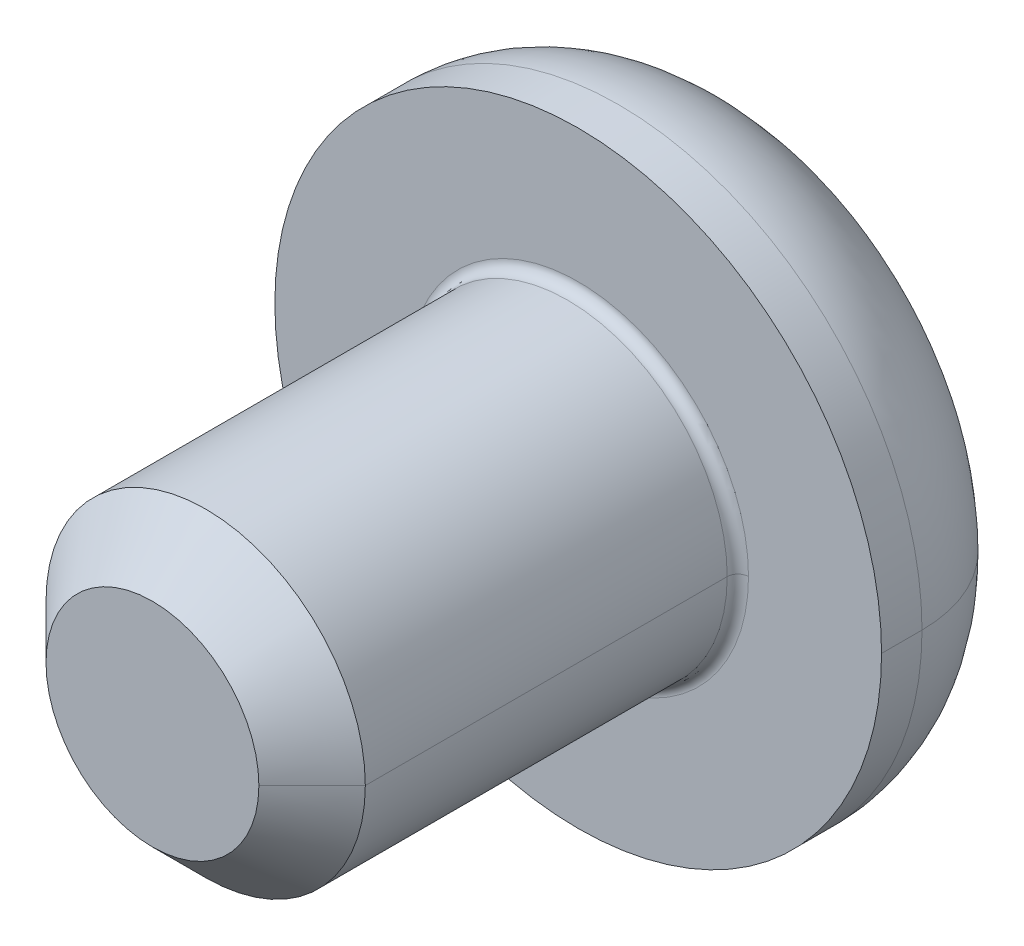
ISO-10303-21;
HEADER;
FILE_DESCRIPTION(('STEP AP214'),'2;1');
FILE_NAME('part.step','',(''),(''),'','','');
FILE_SCHEMA(('AUTOMOTIVE_DESIGN { 1 0 10303 214 1 1 1 1 }'));
ENDSEC;
DATA;
#1=APPLICATION_CONTEXT('core data for automotive mechanical design processes');
#2=APPLICATION_PROTOCOL_DEFINITION('international standard','automotive_design',2000,#1);
#3=PRODUCT_CONTEXT('',#1,'mechanical');
#4=PRODUCT('Part','Part','',(#3));
#5=PRODUCT_RELATED_PRODUCT_CATEGORY('part','',(#4));
#6=PRODUCT_DEFINITION_FORMATION('','',#4);
#7=PRODUCT_DEFINITION_CONTEXT('part definition',#1,'design');
#8=PRODUCT_DEFINITION('design','',#6,#7);
#9=PRODUCT_DEFINITION_SHAPE('','',#8);
#10=(LENGTH_UNIT() NAMED_UNIT(*) SI_UNIT(.MILLI.,.METRE.));
#11=(NAMED_UNIT(*) PLANE_ANGLE_UNIT() SI_UNIT($,.RADIAN.));
#12=(NAMED_UNIT(*) SI_UNIT($,.STERADIAN.) SOLID_ANGLE_UNIT());
#13=UNCERTAINTY_MEASURE_WITH_UNIT(LENGTH_MEASURE(1.E-05),#10,'distance_accuracy_value','');
#14=(GEOMETRIC_REPRESENTATION_CONTEXT(3) GLOBAL_UNCERTAINTY_ASSIGNED_CONTEXT((#13)) GLOBAL_UNIT_ASSIGNED_CONTEXT((#10,
#11,#12)) REPRESENTATION_CONTEXT('',''));
#15=CARTESIAN_POINT('',(0.,0.,0.));
#16=DIRECTION('',(0.,0.,1.));
#17=DIRECTION('',(1.,0.,0.));
#18=AXIS2_PLACEMENT_3D('',#15,#16,#17);
#19=CARTESIAN_POINT('',(0.,0.,0.1));
#20=DIRECTION('',(0.,0.,-1.));
#21=DIRECTION('',(-1.,0.,0.));
#22=AXIS2_PLACEMENT_3D('',#19,#20,#21);
#23=TOROIDAL_SURFACE('',#22,1.6,0.1);
#24=CARTESIAN_POINT('',(1.6,0.,0.1));
#25=DIRECTION('',(0.,1.,0.));
#26=DIRECTION('',(-1.,0.,0.));
#27=AXIS2_PLACEMENT_3D('',#24,#25,#26);
#28=CIRCLE('',#27,0.1);
#29=CARTESIAN_POINT('',(1.6,0.,0.));
#30=VERTEX_POINT('',#29);
#31=CARTESIAN_POINT('',(1.5,0.,0.1));
#32=VERTEX_POINT('',#31);
#33=EDGE_CURVE('E227',#30,#32,#28,.T.);
#34=ORIENTED_EDGE('',*,*,#33,.F.);
#35=CARTESIAN_POINT('',(0.,0.,0.));
#36=DIRECTION('',(0.,0.,-1.));
#37=DIRECTION('',(-1.,0.,0.));
#38=AXIS2_PLACEMENT_3D('',#35,#36,#37);
#39=CIRCLE('',#38,1.6);
#40=CARTESIAN_POINT('',(-1.6,0.,0.));
#41=VERTEX_POINT('',#40);
#42=EDGE_CURVE('E194',#41,#30,#39,.T.);
#43=ORIENTED_EDGE('',*,*,#42,.F.);
#44=CARTESIAN_POINT('',(-1.6,0.,0.1));
#45=DIRECTION('',(0.,-1.,0.));
#46=DIRECTION('',(0.,0.,-1.));
#47=AXIS2_PLACEMENT_3D('',#44,#45,#46);
#48=CIRCLE('',#47,0.1);
#49=CARTESIAN_POINT('',(-1.5,0.,0.1));
#50=VERTEX_POINT('',#49);
#51=EDGE_CURVE('E231',#41,#50,#48,.T.);
#52=ORIENTED_EDGE('',*,*,#51,.T.);
#53=CARTESIAN_POINT('',(0.,0.,0.1));
#54=DIRECTION('',(0.,0.,1.));
#55=DIRECTION('',(-1.,0.,0.));
#56=AXIS2_PLACEMENT_3D('',#53,#54,#55);
#57=CIRCLE('',#56,1.5);
#58=EDGE_CURVE('E263',#32,#50,#57,.T.);
#59=ORIENTED_EDGE('',*,*,#58,.F.);
#60=EDGE_LOOP('',(#34,#43,#52,#59));
#61=FACE_BOUND('',#60,.T.);
#62=ADVANCED_FACE('F17',(#61),#23,.F.);
#63=CARTESIAN_POINT('',(0.,0.,-0.38));
#64=DIRECTION('',(0.,0.,-1.));
#65=DIRECTION('',(-1.,0.,0.));
#66=AXIS2_PLACEMENT_3D('',#63,#64,#65);
#67=TOROIDAL_SURFACE('',#66,1.58,1.27);
#68=CARTESIAN_POINT('',(1.58,0.,-0.38));
#69=DIRECTION('',(0.,1.,0.));
#70=DIRECTION('',(-1.,0.,0.));
#71=AXIS2_PLACEMENT_3D('',#68,#69,#70);
#72=CIRCLE('',#71,1.27);
#73=CARTESIAN_POINT('',(2.85,0.,-0.38));
#74=VERTEX_POINT('',#73);
#75=CARTESIAN_POINT('',(1.58,0.,-1.65));
#76=VERTEX_POINT('',#75);
#77=EDGE_CURVE('E244',#74,#76,#72,.T.);
#78=ORIENTED_EDGE('',*,*,#77,.F.);
#79=CARTESIAN_POINT('',(0.,0.,-0.38));
#80=DIRECTION('',(0.,0.,1.));
#81=DIRECTION('',(-1.,0.,0.));
#82=AXIS2_PLACEMENT_3D('',#79,#80,#81);
#83=CIRCLE('',#82,2.85);
#84=CARTESIAN_POINT('',(-2.85,0.,-0.38));
#85=VERTEX_POINT('',#84);
#86=EDGE_CURVE('E302',#85,#74,#83,.T.);
#87=ORIENTED_EDGE('',*,*,#86,.F.);
#88=CARTESIAN_POINT('',(-1.58,0.,-0.38));
#89=DIRECTION('',(0.,-1.,0.));
#90=DIRECTION('',(0.,0.,-1.));
#91=AXIS2_PLACEMENT_3D('',#88,#89,#90);
#92=CIRCLE('',#91,1.27);
#93=CARTESIAN_POINT('',(-1.58,0.,-1.65));
#94=VERTEX_POINT('',#93);
#95=EDGE_CURVE('E243',#85,#94,#92,.T.);
#96=ORIENTED_EDGE('',*,*,#95,.T.);
#97=CARTESIAN_POINT('',(0.,0.,-1.65));
#98=DIRECTION('',(0.,0.,-1.));
#99=DIRECTION('',(-1.,0.,0.));
#100=AXIS2_PLACEMENT_3D('',#97,#98,#99);
#101=CIRCLE('',#100,1.58);
#102=EDGE_CURVE('E180',#76,#94,#101,.T.);
#103=ORIENTED_EDGE('',*,*,#102,.F.);
#104=EDGE_LOOP('',(#78,#87,#96,#103));
#105=FACE_BOUND('',#104,.T.);
#106=ADVANCED_FACE('F595',(#105),#67,.T.);
#107=CARTESIAN_POINT('',(0.,0.,-0.61));
#108=DIRECTION('',(0.,0.,-1.));
#109=DIRECTION('',(0.,-1.,0.));
#110=AXIS2_PLACEMENT_3D('',#107,#108,#109);
#111=PLANE('',#110);
#112=DIRECTION('',(-1.,0.,0.));
#113=VECTOR('',#112,1.);
#114=CARTESIAN_POINT('',(0.577350269189626,-1.,-0.61));
#115=LINE('',#114,#113);
#116=CARTESIAN_POINT('',(0.577350269189626,-1.,-0.61));
#117=VERTEX_POINT('',#116);
#118=CARTESIAN_POINT('',(-0.577350269189626,-1.,-0.61));
#119=VERTEX_POINT('',#118);
#120=EDGE_CURVE('E198',#117,#119,#115,.T.);
#121=ORIENTED_EDGE('',*,*,#120,.T.);
#122=DIRECTION('',(-0.5,0.866025403784439,0.));
#123=VECTOR('',#122,1.);
#124=CARTESIAN_POINT('',(-0.577350269189626,-1.,-0.61));
#125=LINE('',#124,#123);
#126=CARTESIAN_POINT('',(-1.15470053837925,0.,-0.61));
#127=VERTEX_POINT('',#126);
#128=EDGE_CURVE('E11',#119,#127,#125,.T.);
#129=ORIENTED_EDGE('',*,*,#128,.T.);
#130=DIRECTION('',(0.5,0.866025403784439,0.));
#131=VECTOR('',#130,1.);
#132=CARTESIAN_POINT('',(-1.15470053837925,0.,-0.61));
#133=LINE('',#132,#131);
#134=CARTESIAN_POINT('',(-0.577350269189626,1.,-0.61));
#135=VERTEX_POINT('',#134);
#136=EDGE_CURVE('E45',#127,#135,#133,.T.);
#137=ORIENTED_EDGE('',*,*,#136,.T.);
#138=DIRECTION('',(1.,0.,0.));
#139=VECTOR('',#138,1.);
#140=CARTESIAN_POINT('',(-0.577350269189626,1.,-0.61));
#141=LINE('',#140,#139);
#142=CARTESIAN_POINT('',(0.577350269189626,1.,-0.61));
#143=VERTEX_POINT('',#142);
#144=EDGE_CURVE('E208',#135,#143,#141,.T.);
#145=ORIENTED_EDGE('',*,*,#144,.T.);
#146=DIRECTION('',(0.5,-0.866025403784439,0.));
#147=VECTOR('',#146,1.);
#148=CARTESIAN_POINT('',(0.577350269189626,1.,-0.61));
#149=LINE('',#148,#147);
#150=CARTESIAN_POINT('',(1.15470053837925,0.,-0.61));
#151=VERTEX_POINT('',#150);
#152=EDGE_CURVE('E157',#143,#151,#149,.T.);
#153=ORIENTED_EDGE('',*,*,#152,.T.);
#154=DIRECTION('',(-0.5,-0.866025403784439,0.));
#155=VECTOR('',#154,1.);
#156=CARTESIAN_POINT('',(1.15470053837925,0.,-0.61));
#157=LINE('',#156,#155);
#158=EDGE_CURVE('E153',#151,#117,#157,.T.);
#159=ORIENTED_EDGE('',*,*,#158,.T.);
#160=EDGE_LOOP('',(#121,#129,#137,#145,#153,#159));
#161=FACE_BOUND('',#160,.T.);
#162=ADVANCED_FACE('F586',(#161),#111,.T.);
#163=CARTESIAN_POINT('',(-0.577350269189626,-1.,-0.61));
#164=DIRECTION('',(-0.866025403784439,-0.5,0.));
#165=DIRECTION('',(-0.5,0.866025403784439,0.));
#166=AXIS2_PLACEMENT_3D('',#163,#164,#165);
#167=PLANE('',#166);
#168=DIRECTION('',(-0.5,0.866025403784439,0.));
#169=VECTOR('',#168,1.);
#170=CARTESIAN_POINT('',(-0.577350269189626,-1.,-1.65));
#171=LINE('',#170,#169);
#172=CARTESIAN_POINT('',(-0.577350269189626,-1.,-1.65));
#173=VERTEX_POINT('',#172);
#174=CARTESIAN_POINT('',(-1.15470053837925,0.,-1.65));
#175=VERTEX_POINT('',#174);
#176=EDGE_CURVE('E190',#173,#175,#171,.T.);
#177=ORIENTED_EDGE('',*,*,#176,.T.);
#178=DIRECTION('',(0.,0.,-1.));
#179=VECTOR('',#178,1.);
#180=CARTESIAN_POINT('',(-1.15470053837925,0.,-0.61));
#181=LINE('',#180,#179);
#182=EDGE_CURVE('E20',#127,#175,#181,.T.);
#183=ORIENTED_EDGE('',*,*,#182,.F.);
#184=ORIENTED_EDGE('',*,*,#128,.F.);
#185=DIRECTION('',(0.,0.,-1.));
#186=VECTOR('',#185,1.);
#187=CARTESIAN_POINT('',(-0.577350269189626,-1.,-0.61));
#188=LINE('',#187,#186);
#189=EDGE_CURVE('E197',#119,#173,#188,.T.);
#190=ORIENTED_EDGE('',*,*,#189,.T.);
#191=EDGE_LOOP('',(#177,#183,#184,#190));
#192=FACE_BOUND('',#191,.T.);
#193=ADVANCED_FACE('F577',(#192),#167,.F.);
#194=CARTESIAN_POINT('',(-1.15470053837925,0.,-0.61));
#195=DIRECTION('',(-0.866025403784439,0.5,0.));
#196=DIRECTION('',(0.,0.,1.));
#197=AXIS2_PLACEMENT_3D('',#194,#195,#196);
#198=PLANE('',#197);
#199=DIRECTION('',(0.5,0.866025403784439,0.));
#200=VECTOR('',#199,1.);
#201=CARTESIAN_POINT('',(-1.15470053837925,0.,-1.65));
#202=LINE('',#201,#200);
#203=CARTESIAN_POINT('',(-0.577350269189626,1.,-1.65));
#204=VERTEX_POINT('',#203);
#205=EDGE_CURVE('E186',#175,#204,#202,.T.);
#206=ORIENTED_EDGE('',*,*,#205,.T.);
#207=DIRECTION('',(0.,0.,-1.));
#208=VECTOR('',#207,1.);
#209=CARTESIAN_POINT('',(-0.577350269189626,1.,-0.61));
#210=LINE('',#209,#208);
#211=EDGE_CURVE('E210',#135,#204,#210,.T.);
#212=ORIENTED_EDGE('',*,*,#211,.F.);
#213=ORIENTED_EDGE('',*,*,#136,.F.);
#214=ORIENTED_EDGE('',*,*,#182,.T.);
#215=EDGE_LOOP('',(#206,#212,#213,#214));
#216=FACE_BOUND('',#215,.T.);
#217=ADVANCED_FACE('F479',(#216),#198,.F.);
#218=CARTESIAN_POINT('',(-0.577350269189626,1.,-0.61));
#219=DIRECTION('',(0.,1.,0.));
#220=DIRECTION('',(1.,0.,0.));
#221=AXIS2_PLACEMENT_3D('',#218,#219,#220);
#222=PLANE('',#221);
#223=DIRECTION('',(1.,0.,0.));
#224=VECTOR('',#223,1.);
#225=CARTESIAN_POINT('',(-0.577350269189626,1.,-1.65));
#226=LINE('',#225,#224);
#227=CARTESIAN_POINT('',(0.577350269189626,1.,-1.65));
#228=VERTEX_POINT('',#227);
#229=EDGE_CURVE('E168',#204,#228,#226,.T.);
#230=ORIENTED_EDGE('',*,*,#229,.T.);
#231=DIRECTION('',(0.,0.,-1.));
#232=VECTOR('',#231,1.);
#233=CARTESIAN_POINT('',(0.577350269189626,1.,-0.61));
#234=LINE('',#233,#232);
#235=EDGE_CURVE('E163',#143,#228,#234,.T.);
#236=ORIENTED_EDGE('',*,*,#235,.F.);
#237=ORIENTED_EDGE('',*,*,#144,.F.);
#238=ORIENTED_EDGE('',*,*,#211,.T.);
#239=EDGE_LOOP('',(#230,#236,#237,#238));
#240=FACE_BOUND('',#239,.T.);
#241=ADVANCED_FACE('F464',(#240),#222,.F.);
#242=CARTESIAN_POINT('',(0.577350269189626,1.,-0.61));
#243=DIRECTION('',(0.866025403784439,0.5,0.));
#244=DIRECTION('',(0.,0.,-1.));
#245=AXIS2_PLACEMENT_3D('',#242,#243,#244);
#246=PLANE('',#245);
#247=DIRECTION('',(0.5,-0.866025403784439,0.));
#248=VECTOR('',#247,1.);
#249=CARTESIAN_POINT('',(0.577350269189626,1.,-1.65));
#250=LINE('',#249,#248);
#251=CARTESIAN_POINT('',(1.15470053837925,0.,-1.65));
#252=VERTEX_POINT('',#251);
#253=EDGE_CURVE('E160',#228,#252,#250,.T.);
#254=ORIENTED_EDGE('',*,*,#253,.T.);
#255=DIRECTION('',(0.,0.,-1.));
#256=VECTOR('',#255,1.);
#257=CARTESIAN_POINT('',(1.15470053837925,0.,-0.61));
#258=LINE('',#257,#256);
#259=EDGE_CURVE('E146',#151,#252,#258,.T.);
#260=ORIENTED_EDGE('',*,*,#259,.F.);
#261=ORIENTED_EDGE('',*,*,#152,.F.);
#262=ORIENTED_EDGE('',*,*,#235,.T.);
#263=EDGE_LOOP('',(#254,#260,#261,#262));
#264=FACE_BOUND('',#263,.T.);
#265=ADVANCED_FACE('F161',(#264),#246,.F.);
#266=CARTESIAN_POINT('',(1.15470053837925,0.,-0.61));
#267=DIRECTION('',(0.866025403784439,-0.5,0.));
#268=DIRECTION('',(0.,0.,-1.));
#269=AXIS2_PLACEMENT_3D('',#266,#267,#268);
#270=PLANE('',#269);
#271=DIRECTION('',(-0.5,-0.866025403784439,0.));
#272=VECTOR('',#271,1.);
#273=CARTESIAN_POINT('',(1.15470053837925,0.,-1.65));
#274=LINE('',#273,#272);
#275=CARTESIAN_POINT('',(0.577350269189626,-1.,-1.65));
#276=VERTEX_POINT('',#275);
#277=EDGE_CURVE('E151',#252,#276,#274,.T.);
#278=ORIENTED_EDGE('',*,*,#277,.T.);
#279=DIRECTION('',(0.,0.,-1.));
#280=VECTOR('',#279,1.);
#281=CARTESIAN_POINT('',(0.577350269189626,-1.,-0.61));
#282=LINE('',#281,#280);
#283=EDGE_CURVE('E201',#117,#276,#282,.T.);
#284=ORIENTED_EDGE('',*,*,#283,.F.);
#285=ORIENTED_EDGE('',*,*,#158,.F.);
#286=ORIENTED_EDGE('',*,*,#259,.T.);
#287=EDGE_LOOP('',(#278,#284,#285,#286));
#288=FACE_BOUND('',#287,.T.);
#289=ADVANCED_FACE('F148',(#288),#270,.F.);
#290=CARTESIAN_POINT('',(0.577350269189626,-1.,-0.61));
#291=DIRECTION('',(0.,-1.,0.));
#292=DIRECTION('',(-1.,0.,0.));
#293=AXIS2_PLACEMENT_3D('',#290,#291,#292);
#294=PLANE('',#293);
#295=DIRECTION('',(-1.,0.,0.));
#296=VECTOR('',#295,1.);
#297=CARTESIAN_POINT('',(0.577350269189626,-1.,-1.65));
#298=LINE('',#297,#296);
#299=EDGE_CURVE('E174',#276,#173,#298,.T.);
#300=ORIENTED_EDGE('',*,*,#299,.T.);
#301=ORIENTED_EDGE('',*,*,#189,.F.);
#302=ORIENTED_EDGE('',*,*,#120,.F.);
#303=ORIENTED_EDGE('',*,*,#283,.T.);
#304=EDGE_LOOP('',(#300,#301,#302,#303));
#305=FACE_BOUND('',#304,.T.);
#306=ADVANCED_FACE('F510',(#305),#294,.F.);
#307=CARTESIAN_POINT('',(0.,0.,0.));
#308=DIRECTION('',(0.,0.,-1.));
#309=DIRECTION('',(0.,-1.,0.));
#310=AXIS2_PLACEMENT_3D('',#307,#308,#309);
#311=PLANE('',#310);
#312=ORIENTED_EDGE('',*,*,#42,.T.);
#313=CARTESIAN_POINT('',(0.,0.,0.));
#314=DIRECTION('',(0.,0.,-1.));
#315=DIRECTION('',(-1.,0.,0.));
#316=AXIS2_PLACEMENT_3D('',#313,#314,#315);
#317=CIRCLE('',#316,1.6);
#318=EDGE_CURVE('E225',#30,#41,#317,.T.);
#319=ORIENTED_EDGE('',*,*,#318,.T.);
#320=EDGE_LOOP('',(#312,#319));
#321=FACE_BOUND('',#320,.T.);
#322=CARTESIAN_POINT('',(0.,0.,0.));
#323=DIRECTION('',(0.,0.,-1.));
#324=DIRECTION('',(-1.,0.,0.));
#325=AXIS2_PLACEMENT_3D('',#322,#323,#324);
#326=CIRCLE('',#325,2.85);
#327=CARTESIAN_POINT('',(2.85,0.,0.));
#328=VERTEX_POINT('',#327);
#329=CARTESIAN_POINT('',(-2.85,0.,0.));
#330=VERTEX_POINT('',#329);
#331=EDGE_CURVE('E300',#328,#330,#326,.T.);
#332=ORIENTED_EDGE('',*,*,#331,.F.);
#333=CARTESIAN_POINT('',(0.,0.,0.));
#334=DIRECTION('',(0.,0.,-1.));
#335=DIRECTION('',(-1.,0.,0.));
#336=AXIS2_PLACEMENT_3D('',#333,#334,#335);
#337=CIRCLE('',#336,2.85);
#338=EDGE_CURVE('E258',#330,#328,#337,.T.);
#339=ORIENTED_EDGE('',*,*,#338,.F.);
#340=EDGE_LOOP('',(#332,#339));
#341=FACE_BOUND('',#340,.T.);
#342=ADVANCED_FACE('F315',(#321,#341),#311,.F.);
#343=CARTESIAN_POINT('',(0.,0.,-1.65));
#344=DIRECTION('',(0.,0.,-1.));
#345=DIRECTION('',(0.,-1.,0.));
#346=AXIS2_PLACEMENT_3D('',#343,#344,#345);
#347=PLANE('',#346);
#348=ORIENTED_EDGE('',*,*,#299,.F.);
#349=ORIENTED_EDGE('',*,*,#277,.F.);
#350=ORIENTED_EDGE('',*,*,#253,.F.);
#351=ORIENTED_EDGE('',*,*,#229,.F.);
#352=ORIENTED_EDGE('',*,*,#205,.F.);
#353=ORIENTED_EDGE('',*,*,#176,.F.);
#354=EDGE_LOOP('',(#348,#349,#350,#351,#352,#353));
#355=FACE_BOUND('',#354,.T.);
#356=CARTESIAN_POINT('',(0.,0.,-1.65));
#357=DIRECTION('',(0.,0.,-1.));
#358=DIRECTION('',(-1.,0.,0.));
#359=AXIS2_PLACEMENT_3D('',#356,#357,#358);
#360=CIRCLE('',#359,1.58);
#361=EDGE_CURVE('E239',#94,#76,#360,.T.);
#362=ORIENTED_EDGE('',*,*,#361,.T.);
#363=ORIENTED_EDGE('',*,*,#102,.T.);
#364=EDGE_LOOP('',(#362,#363));
#365=FACE_BOUND('',#364,.T.);
#366=ADVANCED_FACE('F170',(#355,#365),#347,.T.);
#367=CARTESIAN_POINT('',(0.,0.,-1.65));
#368=DIRECTION('',(0.,0.,1.));
#369=DIRECTION('',(1.,0.,0.));
#370=AXIS2_PLACEMENT_3D('',#367,#368,#369);
#371=CYLINDRICAL_SURFACE('',#370,2.85);
#372=DIRECTION('',(0.,0.,1.));
#373=VECTOR('',#372,1.);
#374=CARTESIAN_POINT('',(-2.85,0.,-1.65));
#375=LINE('',#374,#373);
#376=EDGE_CURVE('E271',#85,#330,#375,.T.);
#377=ORIENTED_EDGE('',*,*,#376,.F.);
#378=ORIENTED_EDGE('',*,*,#86,.T.);
#379=DIRECTION('',(0.,0.,1.));
#380=VECTOR('',#379,1.);
#381=CARTESIAN_POINT('',(2.85,0.,-1.65));
#382=LINE('',#381,#380);
#383=EDGE_CURVE('E253',#74,#328,#382,.T.);
#384=ORIENTED_EDGE('',*,*,#383,.T.);
#385=ORIENTED_EDGE('',*,*,#331,.T.);
#386=EDGE_LOOP('',(#377,#378,#384,#385));
#387=FACE_BOUND('',#386,.T.);
#388=ADVANCED_FACE('F311',(#387),#371,.T.);
#389=CARTESIAN_POINT('',(0.,0.,4.));
#390=DIRECTION('',(0.,0.,-1.));
#391=DIRECTION('',(-1.,0.,0.));
#392=AXIS2_PLACEMENT_3D('',#389,#390,#391);
#393=CONICAL_SURFACE('',#392,1.,0.785398163397446);
#394=DIRECTION('',(0.707106781186546,0.,-0.70710678118655));
#395=VECTOR('',#394,1.);
#396=CARTESIAN_POINT('',(1.,0.,4.));
#397=LINE('',#396,#395);
#398=CARTESIAN_POINT('',(1.,0.,4.));
#399=VERTEX_POINT('',#398);
#400=CARTESIAN_POINT('',(1.5,0.,3.5));
#401=VERTEX_POINT('',#400);
#402=EDGE_CURVE('E268',#399,#401,#397,.T.);
#403=ORIENTED_EDGE('',*,*,#402,.F.);
#404=CARTESIAN_POINT('',(0.,0.,4.));
#405=DIRECTION('',(0.,0.,1.));
#406=DIRECTION('',(1.,0.,0.));
#407=AXIS2_PLACEMENT_3D('',#404,#405,#406);
#408=CIRCLE('',#407,1.);
#409=CARTESIAN_POINT('',(-1.,0.,4.));
#410=VERTEX_POINT('',#409);
#411=EDGE_CURVE('E297',#410,#399,#408,.T.);
#412=ORIENTED_EDGE('',*,*,#411,.F.);
#413=DIRECTION('',(-0.707106781186546,0.,-0.70710678118655));
#414=VECTOR('',#413,1.);
#415=CARTESIAN_POINT('',(-1.,0.,4.));
#416=LINE('',#415,#414);
#417=CARTESIAN_POINT('',(-1.5,0.,3.5));
#418=VERTEX_POINT('',#417);
#419=EDGE_CURVE('E264',#410,#418,#416,.T.);
#420=ORIENTED_EDGE('',*,*,#419,.T.);
#421=CARTESIAN_POINT('',(0.,0.,3.5));
#422=DIRECTION('',(0.,0.,-1.));
#423=DIRECTION('',(1.,0.,0.));
#424=AXIS2_PLACEMENT_3D('',#421,#422,#423);
#425=CIRCLE('',#424,1.5);
#426=EDGE_CURVE('E294',#401,#418,#425,.T.);
#427=ORIENTED_EDGE('',*,*,#426,.F.);
#428=EDGE_LOOP('',(#403,#412,#420,#427));
#429=FACE_BOUND('',#428,.T.);
#430=ADVANCED_FACE('F538',(#429),#393,.T.);
#431=CARTESIAN_POINT('',(0.,0.,4.));
#432=DIRECTION('',(0.,0.,1.));
#433=DIRECTION('',(1.,0.,0.));
#434=AXIS2_PLACEMENT_3D('',#431,#432,#433);
#435=PLANE('',#434);
#436=ORIENTED_EDGE('',*,*,#411,.T.);
#437=CARTESIAN_POINT('',(0.,0.,4.));
#438=DIRECTION('',(0.,0.,1.));
#439=DIRECTION('',(1.,0.,0.));
#440=AXIS2_PLACEMENT_3D('',#437,#438,#439);
#441=CIRCLE('',#440,1.);
#442=EDGE_CURVE('E257',#399,#410,#441,.T.);
#443=ORIENTED_EDGE('',*,*,#442,.T.);
#444=EDGE_LOOP('',(#436,#443));
#445=FACE_BOUND('',#444,.T.);
#446=ADVANCED_FACE('F522',(#445),#435,.T.);
#447=CARTESIAN_POINT('',(0.,0.,4.));
#448=DIRECTION('',(0.,0.,-1.));
#449=DIRECTION('',(-1.,0.,0.));
#450=AXIS2_PLACEMENT_3D('',#447,#448,#449);
#451=CYLINDRICAL_SURFACE('',#450,1.5);
#452=DIRECTION('',(0.,0.,-1.));
#453=VECTOR('',#452,1.);
#454=CARTESIAN_POINT('',(1.5,0.,4.));
#455=LINE('',#454,#453);
#456=EDGE_CURVE('E259',#401,#32,#455,.T.);
#457=ORIENTED_EDGE('',*,*,#456,.F.);
#458=ORIENTED_EDGE('',*,*,#426,.T.);
#459=DIRECTION('',(0.,0.,-1.));
#460=VECTOR('',#459,1.);
#461=CARTESIAN_POINT('',(-1.5,0.,4.));
#462=LINE('',#461,#460);
#463=EDGE_CURVE('E291',#418,#50,#462,.T.);
#464=ORIENTED_EDGE('',*,*,#463,.T.);
#465=CARTESIAN_POINT('',(0.,0.,0.1));
#466=DIRECTION('',(0.,0.,1.));
#467=DIRECTION('',(-1.,0.,0.));
#468=AXIS2_PLACEMENT_3D('',#465,#466,#467);
#469=CIRCLE('',#468,1.5);
#470=EDGE_CURVE('E230',#50,#32,#469,.T.);
#471=ORIENTED_EDGE('',*,*,#470,.T.);
#472=EDGE_LOOP('',(#457,#458,#464,#471));
#473=FACE_BOUND('',#472,.T.);
#474=ADVANCED_FACE('F504',(#473),#451,.T.);
#475=CARTESIAN_POINT('',(0.,0.,4.));
#476=DIRECTION('',(0.,0.,-1.));
#477=DIRECTION('',(-1.,0.,0.));
#478=AXIS2_PLACEMENT_3D('',#475,#476,#477);
#479=CYLINDRICAL_SURFACE('',#478,1.5);
#480=CARTESIAN_POINT('',(0.,0.,3.5));
#481=DIRECTION('',(0.,0.,-1.));
#482=DIRECTION('',(1.,0.,0.));
#483=AXIS2_PLACEMENT_3D('',#480,#481,#482);
#484=CIRCLE('',#483,1.5);
#485=EDGE_CURVE('E281',#418,#401,#484,.T.);
#486=ORIENTED_EDGE('',*,*,#485,.T.);
#487=ORIENTED_EDGE('',*,*,#456,.T.);
#488=ORIENTED_EDGE('',*,*,#58,.T.);
#489=ORIENTED_EDGE('',*,*,#463,.F.);
#490=EDGE_LOOP('',(#486,#487,#488,#489));
#491=FACE_BOUND('',#490,.T.);
#492=ADVANCED_FACE('F495',(#491),#479,.T.);
#493=CARTESIAN_POINT('',(0.,0.,4.));
#494=DIRECTION('',(0.,0.,-1.));
#495=DIRECTION('',(-1.,0.,0.));
#496=AXIS2_PLACEMENT_3D('',#493,#494,#495);
#497=CONICAL_SURFACE('',#496,1.,0.785398163397446);
#498=ORIENTED_EDGE('',*,*,#442,.F.);
#499=ORIENTED_EDGE('',*,*,#402,.T.);
#500=ORIENTED_EDGE('',*,*,#485,.F.);
#501=ORIENTED_EDGE('',*,*,#419,.F.);
#502=EDGE_LOOP('',(#498,#499,#500,#501));
#503=FACE_BOUND('',#502,.T.);
#504=ADVANCED_FACE('F487',(#503),#497,.T.);
#505=CARTESIAN_POINT('',(0.,0.,-1.65));
#506=DIRECTION('',(0.,0.,1.));
#507=DIRECTION('',(1.,0.,0.));
#508=AXIS2_PLACEMENT_3D('',#505,#506,#507);
#509=CYLINDRICAL_SURFACE('',#508,2.85);
#510=CARTESIAN_POINT('',(0.,0.,-0.38));
#511=DIRECTION('',(0.,0.,1.));
#512=DIRECTION('',(-1.,0.,0.));
#513=AXIS2_PLACEMENT_3D('',#510,#511,#512);
#514=CIRCLE('',#513,2.85);
#515=EDGE_CURVE('E235',#74,#85,#514,.T.);
#516=ORIENTED_EDGE('',*,*,#515,.T.);
#517=ORIENTED_EDGE('',*,*,#376,.T.);
#518=ORIENTED_EDGE('',*,*,#338,.T.);
#519=ORIENTED_EDGE('',*,*,#383,.F.);
#520=EDGE_LOOP('',(#516,#517,#518,#519));
#521=FACE_BOUND('',#520,.T.);
#522=ADVANCED_FACE('F317',(#521),#509,.T.);
#523=CARTESIAN_POINT('',(0.,0.,-0.38));
#524=DIRECTION('',(0.,0.,-1.));
#525=DIRECTION('',(-1.,0.,0.));
#526=AXIS2_PLACEMENT_3D('',#523,#524,#525);
#527=TOROIDAL_SURFACE('',#526,1.58,1.27);
#528=ORIENTED_EDGE('',*,*,#515,.F.);
#529=ORIENTED_EDGE('',*,*,#77,.T.);
#530=ORIENTED_EDGE('',*,*,#361,.F.);
#531=ORIENTED_EDGE('',*,*,#95,.F.);
#532=EDGE_LOOP('',(#528,#529,#530,#531));
#533=FACE_BOUND('',#532,.T.);
#534=ADVANCED_FACE('F321',(#533),#527,.T.);
#535=CARTESIAN_POINT('',(0.,0.,0.1));
#536=DIRECTION('',(0.,0.,-1.));
#537=DIRECTION('',(-1.,0.,0.));
#538=AXIS2_PLACEMENT_3D('',#535,#536,#537);
#539=TOROIDAL_SURFACE('',#538,1.6,0.1);
#540=ORIENTED_EDGE('',*,*,#318,.F.);
#541=ORIENTED_EDGE('',*,*,#33,.T.);
#542=ORIENTED_EDGE('',*,*,#470,.F.);
#543=ORIENTED_EDGE('',*,*,#51,.F.);
#544=EDGE_LOOP('',(#540,#541,#542,#543));
#545=FACE_BOUND('',#544,.T.);
#546=ADVANCED_FACE('F452',(#545),#539,.F.);
#547=CLOSED_SHELL('',(#62,#106,#162,#193,#217,#241,#265,#289,#306,#342,#366,#388,#430,#446,#474,
#492,#504,#522,#534,#546));
#548=MANIFOLD_SOLID_BREP('B1',#547);
#549=ADVANCED_BREP_SHAPE_REPRESENTATION('',(#18,#548),#14);
#550=SHAPE_DEFINITION_REPRESENTATION(#9,#549);
ENDSEC;
END-ISO-10303-21;
